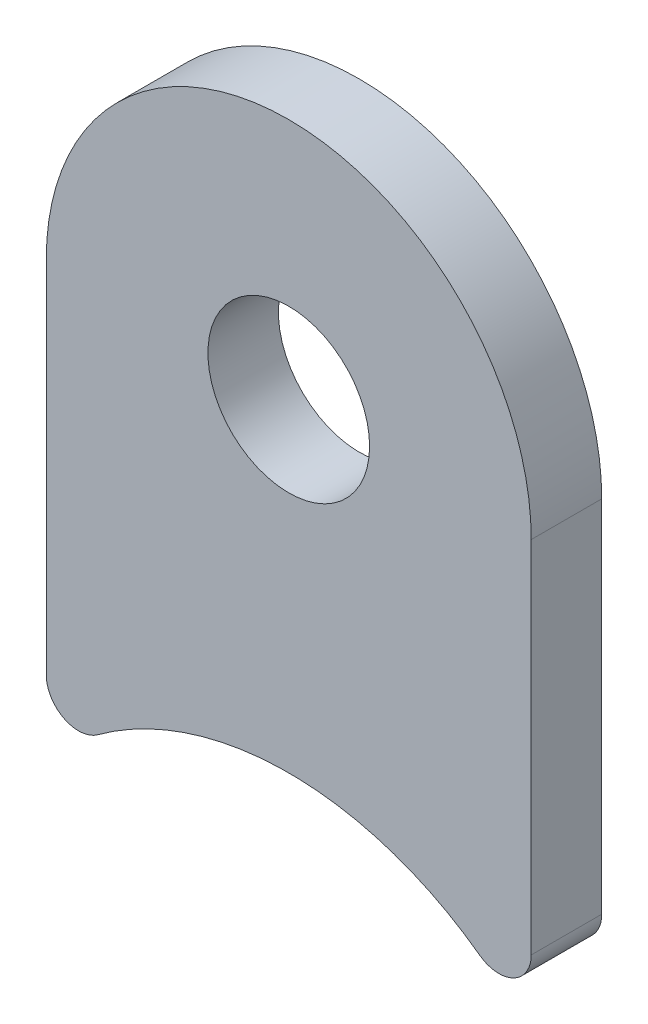
ISO-10303-21;
HEADER;
FILE_DESCRIPTION(('STEP AP214'),'2;1');
FILE_NAME('part.step','',(''),(''),'','','');
FILE_SCHEMA(('AUTOMOTIVE_DESIGN { 1 0 10303 214 1 1 1 1 }'));
ENDSEC;
DATA;
#1=APPLICATION_CONTEXT('core data for automotive mechanical design processes');
#2=APPLICATION_PROTOCOL_DEFINITION('international standard','automotive_design',2000,#1);
#3=PRODUCT_CONTEXT('',#1,'mechanical');
#4=PRODUCT('Part','Part','',(#3));
#5=PRODUCT_RELATED_PRODUCT_CATEGORY('part','',(#4));
#6=PRODUCT_DEFINITION_FORMATION('','',#4);
#7=PRODUCT_DEFINITION_CONTEXT('part definition',#1,'design');
#8=PRODUCT_DEFINITION('design','',#6,#7);
#9=PRODUCT_DEFINITION_SHAPE('','',#8);
#10=(LENGTH_UNIT() NAMED_UNIT(*) SI_UNIT(.MILLI.,.METRE.));
#11=(NAMED_UNIT(*) PLANE_ANGLE_UNIT() SI_UNIT($,.RADIAN.));
#12=(NAMED_UNIT(*) SI_UNIT($,.STERADIAN.) SOLID_ANGLE_UNIT());
#13=UNCERTAINTY_MEASURE_WITH_UNIT(LENGTH_MEASURE(1.E-05),#10,'distance_accuracy_value','');
#14=(GEOMETRIC_REPRESENTATION_CONTEXT(3) GLOBAL_UNCERTAINTY_ASSIGNED_CONTEXT((#13)) GLOBAL_UNIT_ASSIGNED_CONTEXT((#10,
#11,#12)) REPRESENTATION_CONTEXT('',''));
#15=CARTESIAN_POINT('',(0.,0.,0.));
#16=DIRECTION('',(0.,0.,1.));
#17=DIRECTION('',(1.,0.,0.));
#18=AXIS2_PLACEMENT_3D('',#15,#16,#17);
#19=CARTESIAN_POINT('',(8.255,11.2701319868048,1.3843));
#20=DIRECTION('',(0.,0.,-1.));
#21=DIRECTION('',(-1.,0.,0.));
#22=AXIS2_PLACEMENT_3D('',#19,#20,#21);
#23=PLANE('',#22);
#24=CARTESIAN_POINT('',(8.255,11.2701319868048,1.3843));
#25=DIRECTION('',(0.,0.,1.));
#26=DIRECTION('',(-1.,0.,0.));
#27=AXIS2_PLACEMENT_3D('',#24,#25,#26);
#28=CIRCLE('',#27,1.27);
#29=CARTESIAN_POINT('',(7.50454545454545,10.2455745334589,1.3843));
#30=VERTEX_POINT('',#29);
#31=CARTESIAN_POINT('',(9.525,11.2701319868048,1.3843));
#32=VERTEX_POINT('',#31);
#33=EDGE_CURVE('E129',#30,#32,#28,.T.);
#34=ORIENTED_EDGE('',*,*,#33,.T.);
#35=DIRECTION('',(0.,1.,0.));
#36=VECTOR('',#35,1.);
#37=CARTESIAN_POINT('',(9.525,11.2701319868048,1.3843));
#38=LINE('',#37,#36);
#39=CARTESIAN_POINT('',(9.525,25.4,1.3843));
#40=VERTEX_POINT('',#39);
#41=EDGE_CURVE('E87',#32,#40,#38,.T.);
#42=ORIENTED_EDGE('',*,*,#41,.T.);
#43=CARTESIAN_POINT('',(0.,25.4,1.3843));
#44=DIRECTION('',(0.,0.,1.));
#45=DIRECTION('',(1.,0.,0.));
#46=AXIS2_PLACEMENT_3D('',#43,#44,#45);
#47=CIRCLE('',#46,9.525);
#48=CARTESIAN_POINT('',(-9.525,25.4,1.3843));
#49=VERTEX_POINT('',#48);
#50=EDGE_CURVE('E100',#40,#49,#47,.T.);
#51=ORIENTED_EDGE('',*,*,#50,.T.);
#52=DIRECTION('',(0.,-1.,0.));
#53=VECTOR('',#52,1.);
#54=CARTESIAN_POINT('',(-9.525,25.4,1.3843));
#55=LINE('',#54,#53);
#56=CARTESIAN_POINT('',(-9.525,11.2701319868048,1.3843));
#57=VERTEX_POINT('',#56);
#58=EDGE_CURVE('E94',#49,#57,#55,.T.);
#59=ORIENTED_EDGE('',*,*,#58,.T.);
#60=CARTESIAN_POINT('',(-8.255,11.2701319868048,1.3843));
#61=DIRECTION('',(0.,0.,1.));
#62=DIRECTION('',(1.,0.,0.));
#63=AXIS2_PLACEMENT_3D('',#60,#61,#62);
#64=CIRCLE('',#63,1.27);
#65=CARTESIAN_POINT('',(-7.50454545454546,10.2455745334589,1.3843));
#66=VERTEX_POINT('',#65);
#67=EDGE_CURVE('E98',#57,#66,#64,.T.);
#68=ORIENTED_EDGE('',*,*,#67,.T.);
#69=CARTESIAN_POINT('',(0.,0.,1.3843));
#70=DIRECTION('',(0.,0.,-1.));
#71=DIRECTION('',(1.,0.,0.));
#72=AXIS2_PLACEMENT_3D('',#69,#70,#71);
#73=CIRCLE('',#72,12.7);
#74=EDGE_CURVE('E50',#66,#30,#73,.T.);
#75=ORIENTED_EDGE('',*,*,#74,.T.);
#76=EDGE_LOOP('',(#34,#42,#51,#59,#68,#75));
#77=FACE_BOUND('',#76,.T.);
#78=CARTESIAN_POINT('',(0.,25.4,1.3843));
#79=DIRECTION('',(0.,0.,1.));
#80=DIRECTION('',(1.,0.,0.));
#81=AXIS2_PLACEMENT_3D('',#78,#79,#80);
#82=CIRCLE('',#81,3.175);
#83=CARTESIAN_POINT('',(3.175,25.4,1.3843));
#84=VERTEX_POINT('',#83);
#85=EDGE_CURVE('E122',#84,#84,#82,.T.);
#86=ORIENTED_EDGE('',*,*,#85,.F.);
#87=EDGE_LOOP('',(#86));
#88=FACE_BOUND('',#87,.T.);
#89=ADVANCED_FACE('F33',(#77,#88),#23,.F.);
#90=CARTESIAN_POINT('',(8.255,11.2701319868048,-1.3843));
#91=DIRECTION('',(0.,0.,-1.));
#92=DIRECTION('',(-1.,0.,0.));
#93=AXIS2_PLACEMENT_3D('',#90,#91,#92);
#94=PLANE('',#93);
#95=CARTESIAN_POINT('',(8.255,11.2701319868048,-1.3843));
#96=DIRECTION('',(0.,0.,1.));
#97=DIRECTION('',(-1.,0.,0.));
#98=AXIS2_PLACEMENT_3D('',#95,#96,#97);
#99=CIRCLE('',#98,1.27);
#100=CARTESIAN_POINT('',(7.50454545454545,10.2455745334589,-1.3843));
#101=VERTEX_POINT('',#100);
#102=CARTESIAN_POINT('',(9.525,11.2701319868048,-1.3843));
#103=VERTEX_POINT('',#102);
#104=EDGE_CURVE('E118',#101,#103,#99,.T.);
#105=ORIENTED_EDGE('',*,*,#104,.F.);
#106=CARTESIAN_POINT('',(0.,0.,-1.3843));
#107=DIRECTION('',(0.,0.,-1.));
#108=DIRECTION('',(1.,0.,0.));
#109=AXIS2_PLACEMENT_3D('',#106,#107,#108);
#110=CIRCLE('',#109,12.7);
#111=CARTESIAN_POINT('',(-7.50454545454546,10.2455745334589,-1.3843));
#112=VERTEX_POINT('',#111);
#113=EDGE_CURVE('E79',#112,#101,#110,.T.);
#114=ORIENTED_EDGE('',*,*,#113,.F.);
#115=CARTESIAN_POINT('',(-8.255,11.2701319868048,-1.3843));
#116=DIRECTION('',(0.,0.,1.));
#117=DIRECTION('',(1.,0.,0.));
#118=AXIS2_PLACEMENT_3D('',#115,#116,#117);
#119=CIRCLE('',#118,1.27);
#120=CARTESIAN_POINT('',(-9.525,11.2701319868048,-1.3843));
#121=VERTEX_POINT('',#120);
#122=EDGE_CURVE('E73',#121,#112,#119,.T.);
#123=ORIENTED_EDGE('',*,*,#122,.F.);
#124=DIRECTION('',(0.,-1.,0.));
#125=VECTOR('',#124,1.);
#126=CARTESIAN_POINT('',(-9.525,25.4,-1.3843));
#127=LINE('',#126,#125);
#128=CARTESIAN_POINT('',(-9.525,25.4,-1.3843));
#129=VERTEX_POINT('',#128);
#130=EDGE_CURVE('E108',#129,#121,#127,.T.);
#131=ORIENTED_EDGE('',*,*,#130,.F.);
#132=CARTESIAN_POINT('',(0.,25.4,-1.3843));
#133=DIRECTION('',(0.,0.,1.));
#134=DIRECTION('',(1.,0.,0.));
#135=AXIS2_PLACEMENT_3D('',#132,#133,#134);
#136=CIRCLE('',#135,9.525);
#137=CARTESIAN_POINT('',(9.525,25.4,-1.3843));
#138=VERTEX_POINT('',#137);
#139=EDGE_CURVE('E124',#138,#129,#136,.T.);
#140=ORIENTED_EDGE('',*,*,#139,.F.);
#141=DIRECTION('',(0.,1.,0.));
#142=VECTOR('',#141,1.);
#143=CARTESIAN_POINT('',(9.525,11.2701319868048,-1.3843));
#144=LINE('',#143,#142);
#145=EDGE_CURVE('E121',#103,#138,#144,.T.);
#146=ORIENTED_EDGE('',*,*,#145,.F.);
#147=EDGE_LOOP('',(#105,#114,#123,#131,#140,#146));
#148=FACE_BOUND('',#147,.T.);
#149=CARTESIAN_POINT('',(0.,25.4,-1.3843));
#150=DIRECTION('',(0.,0.,1.));
#151=DIRECTION('',(1.,0.,0.));
#152=AXIS2_PLACEMENT_3D('',#149,#150,#151);
#153=CIRCLE('',#152,3.175);
#154=CARTESIAN_POINT('',(3.175,25.4,-1.3843));
#155=VERTEX_POINT('',#154);
#156=EDGE_CURVE('E222',#155,#155,#153,.T.);
#157=ORIENTED_EDGE('',*,*,#156,.T.);
#158=EDGE_LOOP('',(#157));
#159=FACE_BOUND('',#158,.T.);
#160=ADVANCED_FACE('F138',(#148,#159),#94,.T.);
#161=CARTESIAN_POINT('',(8.255,11.2701319868048,1.3843));
#162=DIRECTION('',(0.,0.,-1.));
#163=DIRECTION('',(-1.,0.,0.));
#164=AXIS2_PLACEMENT_3D('',#161,#162,#163);
#165=CYLINDRICAL_SURFACE('',#164,1.27);
#166=ORIENTED_EDGE('',*,*,#104,.T.);
#167=DIRECTION('',(0.,0.,-1.));
#168=VECTOR('',#167,1.);
#169=CARTESIAN_POINT('',(9.525,11.2701319868048,1.3843));
#170=LINE('',#169,#168);
#171=EDGE_CURVE('E11',#32,#103,#170,.T.);
#172=ORIENTED_EDGE('',*,*,#171,.F.);
#173=ORIENTED_EDGE('',*,*,#33,.F.);
#174=DIRECTION('',(0.,0.,-1.));
#175=VECTOR('',#174,1.);
#176=CARTESIAN_POINT('',(7.50454545454545,10.2455745334589,1.3843));
#177=LINE('',#176,#175);
#178=EDGE_CURVE('E114',#30,#101,#177,.T.);
#179=ORIENTED_EDGE('',*,*,#178,.T.);
#180=EDGE_LOOP('',(#166,#172,#173,#179));
#181=FACE_BOUND('',#180,.T.);
#182=ADVANCED_FACE('F35',(#181),#165,.T.);
#183=CARTESIAN_POINT('',(9.525,11.2701319868048,1.3843));
#184=DIRECTION('',(-1.,0.,0.));
#185=DIRECTION('',(0.,0.,1.));
#186=AXIS2_PLACEMENT_3D('',#183,#184,#185);
#187=PLANE('',#186);
#188=ORIENTED_EDGE('',*,*,#145,.T.);
#189=DIRECTION('',(0.,0.,-1.));
#190=VECTOR('',#189,1.);
#191=CARTESIAN_POINT('',(9.525,25.4,1.3843));
#192=LINE('',#191,#190);
#193=EDGE_CURVE('E42',#40,#138,#192,.T.);
#194=ORIENTED_EDGE('',*,*,#193,.F.);
#195=ORIENTED_EDGE('',*,*,#41,.F.);
#196=ORIENTED_EDGE('',*,*,#171,.T.);
#197=EDGE_LOOP('',(#188,#194,#195,#196));
#198=FACE_BOUND('',#197,.T.);
#199=ADVANCED_FACE('F163',(#198),#187,.F.);
#200=CARTESIAN_POINT('',(0.,25.4,1.3843));
#201=DIRECTION('',(0.,0.,-1.));
#202=DIRECTION('',(-1.,0.,0.));
#203=AXIS2_PLACEMENT_3D('',#200,#201,#202);
#204=CYLINDRICAL_SURFACE('',#203,9.525);
#205=ORIENTED_EDGE('',*,*,#139,.T.);
#206=DIRECTION('',(0.,0.,-1.));
#207=VECTOR('',#206,1.);
#208=CARTESIAN_POINT('',(-9.525,25.4,1.3843));
#209=LINE('',#208,#207);
#210=EDGE_CURVE('E109',#49,#129,#209,.T.);
#211=ORIENTED_EDGE('',*,*,#210,.F.);
#212=ORIENTED_EDGE('',*,*,#50,.F.);
#213=ORIENTED_EDGE('',*,*,#193,.T.);
#214=EDGE_LOOP('',(#205,#211,#212,#213));
#215=FACE_BOUND('',#214,.T.);
#216=ADVANCED_FACE('F135',(#215),#204,.T.);
#217=CARTESIAN_POINT('',(-9.525,25.4,1.3843));
#218=DIRECTION('',(1.,0.,0.));
#219=DIRECTION('',(0.,0.,-1.));
#220=AXIS2_PLACEMENT_3D('',#217,#218,#219);
#221=PLANE('',#220);
#222=ORIENTED_EDGE('',*,*,#130,.T.);
#223=DIRECTION('',(0.,0.,-1.));
#224=VECTOR('',#223,1.);
#225=CARTESIAN_POINT('',(-9.525,11.2701319868048,1.3843));
#226=LINE('',#225,#224);
#227=EDGE_CURVE('E105',#57,#121,#226,.T.);
#228=ORIENTED_EDGE('',*,*,#227,.F.);
#229=ORIENTED_EDGE('',*,*,#58,.F.);
#230=ORIENTED_EDGE('',*,*,#210,.T.);
#231=EDGE_LOOP('',(#222,#228,#229,#230));
#232=FACE_BOUND('',#231,.T.);
#233=ADVANCED_FACE('F106',(#232),#221,.F.);
#234=CARTESIAN_POINT('',(-8.255,11.2701319868048,1.3843));
#235=DIRECTION('',(0.,0.,-1.));
#236=DIRECTION('',(-1.,0.,0.));
#237=AXIS2_PLACEMENT_3D('',#234,#235,#236);
#238=CYLINDRICAL_SURFACE('',#237,1.27);
#239=ORIENTED_EDGE('',*,*,#122,.T.);
#240=DIRECTION('',(0.,0.,-1.));
#241=VECTOR('',#240,1.);
#242=CARTESIAN_POINT('',(-7.50454545454546,10.2455745334589,1.3843));
#243=LINE('',#242,#241);
#244=EDGE_CURVE('E110',#66,#112,#243,.T.);
#245=ORIENTED_EDGE('',*,*,#244,.F.);
#246=ORIENTED_EDGE('',*,*,#67,.F.);
#247=ORIENTED_EDGE('',*,*,#227,.T.);
#248=EDGE_LOOP('',(#239,#245,#246,#247));
#249=FACE_BOUND('',#248,.T.);
#250=ADVANCED_FACE('F112',(#249),#238,.T.);
#251=CARTESIAN_POINT('',(0.,0.,1.3843));
#252=DIRECTION('',(0.,0.,-1.));
#253=DIRECTION('',(-1.,0.,0.));
#254=AXIS2_PLACEMENT_3D('',#251,#252,#253);
#255=CYLINDRICAL_SURFACE('',#254,12.7);
#256=ORIENTED_EDGE('',*,*,#113,.T.);
#257=ORIENTED_EDGE('',*,*,#178,.F.);
#258=ORIENTED_EDGE('',*,*,#74,.F.);
#259=ORIENTED_EDGE('',*,*,#244,.T.);
#260=EDGE_LOOP('',(#256,#257,#258,#259));
#261=FACE_BOUND('',#260,.T.);
#262=ADVANCED_FACE('F143',(#261),#255,.F.);
#263=CARTESIAN_POINT('',(0.,25.4,1.3843));
#264=DIRECTION('',(0.,0.,-1.));
#265=DIRECTION('',(-1.,0.,0.));
#266=AXIS2_PLACEMENT_3D('',#263,#264,#265);
#267=CYLINDRICAL_SURFACE('',#266,3.175);
#268=ORIENTED_EDGE('',*,*,#85,.T.);
#269=EDGE_LOOP('',(#268));
#270=FACE_BOUND('',#269,.T.);
#271=ORIENTED_EDGE('',*,*,#156,.F.);
#272=EDGE_LOOP('',(#271));
#273=FACE_BOUND('',#272,.T.);
#274=ADVANCED_FACE('F145',(#270,#273),#267,.F.);
#275=CLOSED_SHELL('',(#89,#160,#182,#199,#216,#233,#250,#262,#274));
#276=MANIFOLD_SOLID_BREP('B2',#275);
#277=ADVANCED_BREP_SHAPE_REPRESENTATION('',(#18,#276),#14);
#278=SHAPE_DEFINITION_REPRESENTATION(#9,#277);
ENDSEC;
END-ISO-10303-21;
